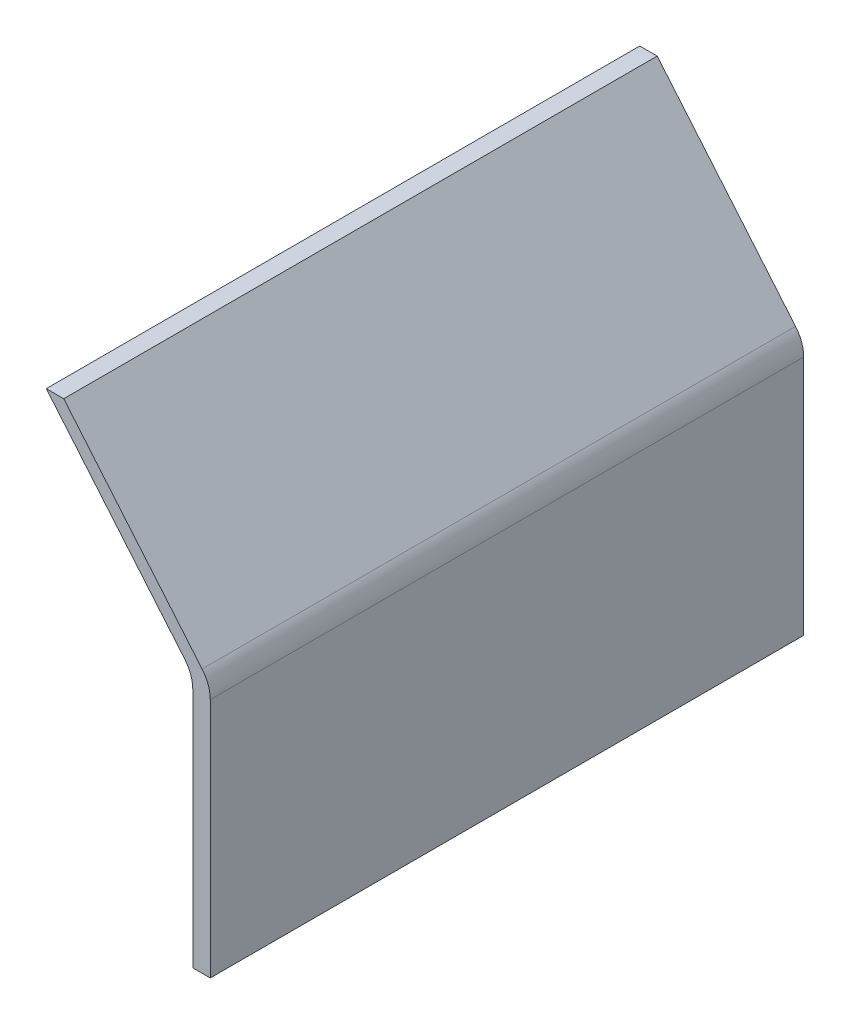
ISO-10303-21;
HEADER;
FILE_DESCRIPTION(('STEP AP214'),'2;1');
FILE_NAME('part.step','',(''),(''),'','','');
FILE_SCHEMA(('AUTOMOTIVE_DESIGN { 1 0 10303 214 1 1 1 1 }'));
ENDSEC;
DATA;
#1=APPLICATION_CONTEXT('core data for automotive mechanical design processes');
#2=APPLICATION_PROTOCOL_DEFINITION('international standard','automotive_design',2000,#1);
#3=PRODUCT_CONTEXT('',#1,'mechanical');
#4=PRODUCT('Part','Part','',(#3));
#5=PRODUCT_RELATED_PRODUCT_CATEGORY('part','',(#4));
#6=PRODUCT_DEFINITION_FORMATION('','',#4);
#7=PRODUCT_DEFINITION_CONTEXT('part definition',#1,'design');
#8=PRODUCT_DEFINITION('design','',#6,#7);
#9=PRODUCT_DEFINITION_SHAPE('','',#8);
#10=(LENGTH_UNIT() NAMED_UNIT(*) SI_UNIT(.MILLI.,.METRE.));
#11=(NAMED_UNIT(*) PLANE_ANGLE_UNIT() SI_UNIT($,.RADIAN.));
#12=(NAMED_UNIT(*) SI_UNIT($,.STERADIAN.) SOLID_ANGLE_UNIT());
#13=UNCERTAINTY_MEASURE_WITH_UNIT(LENGTH_MEASURE(1.E-05),#10,'distance_accuracy_value','');
#14=(GEOMETRIC_REPRESENTATION_CONTEXT(3) GLOBAL_UNCERTAINTY_ASSIGNED_CONTEXT((#13)) GLOBAL_UNIT_ASSIGNED_CONTEXT((#10,
#11,#12)) REPRESENTATION_CONTEXT('',''));
#15=CARTESIAN_POINT('',(0.,0.,0.));
#16=DIRECTION('',(0.,0.,1.));
#17=DIRECTION('',(1.,0.,0.));
#18=AXIS2_PLACEMENT_3D('',#15,#16,#17);
#19=CARTESIAN_POINT('',(0.,72.7,170.));
#20=DIRECTION('',(-1.,0.,0.));
#21=DIRECTION('',(0.,-1.,0.));
#22=AXIS2_PLACEMENT_3D('',#19,#20,#21);
#23=PLANE('',#22);
#24=DIRECTION('',(0.,1.,0.));
#25=VECTOR('',#24,1.);
#26=CARTESIAN_POINT('',(0.,72.7,0.));
#27=LINE('',#26,#25);
#28=CARTESIAN_POINT('',(0.,0.,0.));
#29=VERTEX_POINT('',#28);
#30=CARTESIAN_POINT('',(0.,69.060297657338,0.));
#31=VERTEX_POINT('',#30);
#32=EDGE_CURVE('E145',#29,#31,#27,.T.);
#33=ORIENTED_EDGE('',*,*,#32,.T.);
#34=DIRECTION('',(0.,0.,-1.));
#35=VECTOR('',#34,1.);
#36=CARTESIAN_POINT('',(0.,69.060297657338,170.));
#37=LINE('',#36,#35);
#38=CARTESIAN_POINT('',(0.,69.060297657338,170.));
#39=VERTEX_POINT('',#38);
#40=EDGE_CURVE('E177',#31,#39,#37,.F.);
#41=ORIENTED_EDGE('',*,*,#40,.T.);
#42=DIRECTION('',(0.,1.,0.));
#43=VECTOR('',#42,1.);
#44=CARTESIAN_POINT('',(0.,72.7,170.));
#45=LINE('',#44,#43);
#46=CARTESIAN_POINT('',(0.,0.,170.));
#47=VERTEX_POINT('',#46);
#48=EDGE_CURVE('E116',#47,#39,#45,.T.);
#49=ORIENTED_EDGE('',*,*,#48,.F.);
#50=DIRECTION('',(0.,0.,-1.));
#51=VECTOR('',#50,1.);
#52=CARTESIAN_POINT('',(0.,0.,170.));
#53=LINE('',#52,#51);
#54=EDGE_CURVE('E144',#47,#29,#53,.T.);
#55=ORIENTED_EDGE('',*,*,#54,.T.);
#56=EDGE_LOOP('',(#33,#41,#49,#55));
#57=FACE_BOUND('',#56,.T.);
#58=ADVANCED_FACE('F39',(#57),#23,.F.);
#59=CARTESIAN_POINT('',(-41.9740309125311,122.722702135669,170.));
#60=DIRECTION('',(-0.766044443118977,-0.64278760968654,0.));
#61=DIRECTION('',(0.64278760968654,-0.766044443118977,0.));
#62=AXIS2_PLACEMENT_3D('',#59,#60,#61);
#63=PLANE('',#62);
#64=DIRECTION('',(-0.64278760968654,0.766044443118977,0.));
#65=VECTOR('',#64,1.);
#66=CARTESIAN_POINT('',(-41.9740309125311,122.722702135669,170.));
#67=LINE('',#66,#65);
#68=CARTESIAN_POINT('',(-2.33955556881023,75.4881737542034,170.));
#69=VERTEX_POINT('',#68);
#70=CARTESIAN_POINT('',(-41.9740309125311,122.722702135669,170.));
#71=VERTEX_POINT('',#70);
#72=EDGE_CURVE('E103',#69,#71,#67,.T.);
#73=ORIENTED_EDGE('',*,*,#72,.F.);
#74=DIRECTION('',(0.,0.,-1.));
#75=VECTOR('',#74,1.);
#76=CARTESIAN_POINT('',(-2.33955556881022,75.4881737542034,170.));
#77=LINE('',#76,#75);
#78=CARTESIAN_POINT('',(-2.33955556881023,75.4881737542034,0.));
#79=VERTEX_POINT('',#78);
#80=EDGE_CURVE('E126',#69,#79,#77,.T.);
#81=ORIENTED_EDGE('',*,*,#80,.T.);
#82=DIRECTION('',(-0.64278760968654,0.766044443118977,0.));
#83=VECTOR('',#82,1.);
#84=CARTESIAN_POINT('',(-41.9740309125311,122.722702135669,0.));
#85=LINE('',#84,#83);
#86=CARTESIAN_POINT('',(-41.9740309125311,122.722702135669,0.));
#87=VERTEX_POINT('',#86);
#88=EDGE_CURVE('E122',#79,#87,#85,.T.);
#89=ORIENTED_EDGE('',*,*,#88,.T.);
#90=DIRECTION('',(0.,0.,-1.));
#91=VECTOR('',#90,1.);
#92=CARTESIAN_POINT('',(-41.9740309125311,122.722702135669,170.));
#93=LINE('',#92,#91);
#94=EDGE_CURVE('E119',#71,#87,#93,.T.);
#95=ORIENTED_EDGE('',*,*,#94,.F.);
#96=EDGE_LOOP('',(#73,#81,#89,#95));
#97=FACE_BOUND('',#96,.T.);
#98=ADVANCED_FACE('F120',(#97),#63,.F.);
#99=CARTESIAN_POINT('',(-46.9740309125311,122.722702135669,170.));
#100=DIRECTION('',(0.,-1.,0.));
#101=DIRECTION('',(1.,0.,0.));
#102=AXIS2_PLACEMENT_3D('',#99,#100,#101);
#103=PLANE('',#102);
#104=DIRECTION('',(-1.,0.,0.));
#105=VECTOR('',#104,1.);
#106=CARTESIAN_POINT('',(-46.9740309125311,122.722702135669,0.));
#107=LINE('',#106,#105);
#108=CARTESIAN_POINT('',(-46.9740309125311,122.722702135669,0.));
#109=VERTEX_POINT('',#108);
#110=EDGE_CURVE('E151',#87,#109,#107,.T.);
#111=ORIENTED_EDGE('',*,*,#110,.T.);
#112=DIRECTION('',(0.,0.,-1.));
#113=VECTOR('',#112,1.);
#114=CARTESIAN_POINT('',(-46.9740309125311,122.722702135669,170.));
#115=LINE('',#114,#113);
#116=CARTESIAN_POINT('',(-46.9740309125311,122.722702135669,170.));
#117=VERTEX_POINT('',#116);
#118=EDGE_CURVE('E127',#117,#109,#115,.T.);
#119=ORIENTED_EDGE('',*,*,#118,.F.);
#120=DIRECTION('',(-1.,0.,0.));
#121=VECTOR('',#120,1.);
#122=CARTESIAN_POINT('',(-46.9740309125311,122.722702135669,170.));
#123=LINE('',#122,#121);
#124=EDGE_CURVE('E108',#71,#117,#123,.T.);
#125=ORIENTED_EDGE('',*,*,#124,.F.);
#126=ORIENTED_EDGE('',*,*,#94,.T.);
#127=EDGE_LOOP('',(#111,#119,#125,#126));
#128=FACE_BOUND('',#127,.T.);
#129=ADVANCED_FACE('F129',(#128),#103,.F.);
#130=CARTESIAN_POINT('',(-5.,72.7,170.));
#131=DIRECTION('',(0.766044443118977,0.64278760968654,0.));
#132=DIRECTION('',(-0.64278760968654,0.766044443118977,0.));
#133=AXIS2_PLACEMENT_3D('',#130,#131,#132);
#134=PLANE('',#133);
#135=DIRECTION('',(0.64278760968654,-0.766044443118977,0.));
#136=VECTOR('',#135,1.);
#137=CARTESIAN_POINT('',(-5.,72.7,0.));
#138=LINE('',#137,#136);
#139=CARTESIAN_POINT('',(-7.33955556881023,75.4881737542034,0.));
#140=VERTEX_POINT('',#139);
#141=EDGE_CURVE('E154',#109,#140,#138,.T.);
#142=ORIENTED_EDGE('',*,*,#141,.T.);
#143=DIRECTION('',(0.,0.,-1.));
#144=VECTOR('',#143,1.);
#145=CARTESIAN_POINT('',(-7.33955556881023,75.4881737542034,170.));
#146=LINE('',#145,#144);
#147=CARTESIAN_POINT('',(-7.33955556881023,75.4881737542034,170.));
#148=VERTEX_POINT('',#147);
#149=EDGE_CURVE('E61',#140,#148,#146,.F.);
#150=ORIENTED_EDGE('',*,*,#149,.T.);
#151=DIRECTION('',(0.64278760968654,-0.766044443118977,0.));
#152=VECTOR('',#151,1.);
#153=CARTESIAN_POINT('',(-5.,72.7,170.));
#154=LINE('',#153,#152);
#155=EDGE_CURVE('E132',#117,#148,#154,.T.);
#156=ORIENTED_EDGE('',*,*,#155,.F.);
#157=ORIENTED_EDGE('',*,*,#118,.T.);
#158=EDGE_LOOP('',(#142,#150,#156,#157));
#159=FACE_BOUND('',#158,.T.);
#160=ADVANCED_FACE('F195',(#159),#134,.F.);
#161=CARTESIAN_POINT('',(-5.,0.,170.));
#162=DIRECTION('',(1.,0.,0.));
#163=DIRECTION('',(0.,1.,0.));
#164=AXIS2_PLACEMENT_3D('',#161,#162,#163);
#165=PLANE('',#164);
#166=DIRECTION('',(0.,-1.,0.));
#167=VECTOR('',#166,1.);
#168=CARTESIAN_POINT('',(-5.,0.,170.));
#169=LINE('',#168,#167);
#170=CARTESIAN_POINT('',(-5.,69.060297657338,170.));
#171=VERTEX_POINT('',#170);
#172=CARTESIAN_POINT('',(-5.,0.,170.));
#173=VERTEX_POINT('',#172);
#174=EDGE_CURVE('E135',#171,#173,#169,.T.);
#175=ORIENTED_EDGE('',*,*,#174,.F.);
#176=DIRECTION('',(0.,0.,-1.));
#177=VECTOR('',#176,1.);
#178=CARTESIAN_POINT('',(-5.,69.060297657338,0.));
#179=LINE('',#178,#177);
#180=CARTESIAN_POINT('',(-5.,69.060297657338,0.));
#181=VERTEX_POINT('',#180);
#182=EDGE_CURVE('E182',#171,#181,#179,.T.);
#183=ORIENTED_EDGE('',*,*,#182,.T.);
#184=DIRECTION('',(0.,-1.,0.));
#185=VECTOR('',#184,1.);
#186=CARTESIAN_POINT('',(-5.,0.,0.));
#187=LINE('',#186,#185);
#188=CARTESIAN_POINT('',(-5.,0.,0.));
#189=VERTEX_POINT('',#188);
#190=EDGE_CURVE('E157',#181,#189,#187,.T.);
#191=ORIENTED_EDGE('',*,*,#190,.T.);
#192=DIRECTION('',(0.,0.,-1.));
#193=VECTOR('',#192,1.);
#194=CARTESIAN_POINT('',(-5.,0.,170.));
#195=LINE('',#194,#193);
#196=EDGE_CURVE('E166',#173,#189,#195,.T.);
#197=ORIENTED_EDGE('',*,*,#196,.F.);
#198=EDGE_LOOP('',(#175,#183,#191,#197));
#199=FACE_BOUND('',#198,.T.);
#200=ADVANCED_FACE('F197',(#199),#165,.F.);
#201=CARTESIAN_POINT('',(0.,0.,170.));
#202=DIRECTION('',(0.,1.,0.));
#203=DIRECTION('',(-1.,0.,0.));
#204=AXIS2_PLACEMENT_3D('',#201,#202,#203);
#205=PLANE('',#204);
#206=DIRECTION('',(1.,0.,0.));
#207=VECTOR('',#206,1.);
#208=CARTESIAN_POINT('',(0.,0.,0.));
#209=LINE('',#208,#207);
#210=EDGE_CURVE('E160',#189,#29,#209,.T.);
#211=ORIENTED_EDGE('',*,*,#210,.T.);
#212=ORIENTED_EDGE('',*,*,#54,.F.);
#213=DIRECTION('',(1.,0.,0.));
#214=VECTOR('',#213,1.);
#215=CARTESIAN_POINT('',(0.,0.,170.));
#216=LINE('',#215,#214);
#217=EDGE_CURVE('E141',#173,#47,#216,.T.);
#218=ORIENTED_EDGE('',*,*,#217,.F.);
#219=ORIENTED_EDGE('',*,*,#196,.T.);
#220=EDGE_LOOP('',(#211,#212,#218,#219));
#221=FACE_BOUND('',#220,.T.);
#222=ADVANCED_FACE('F203',(#221),#205,.F.);
#223=CARTESIAN_POINT('',(0.,0.,170.));
#224=DIRECTION('',(0.,0.,-1.));
#225=DIRECTION('',(-1.,0.,0.));
#226=AXIS2_PLACEMENT_3D('',#223,#224,#225);
#227=PLANE('',#226);
#228=ORIENTED_EDGE('',*,*,#48,.T.);
#229=CARTESIAN_POINT('',(-9.99999999999999,69.060297657338,170.));
#230=DIRECTION('',(0.,0.,-1.));
#231=DIRECTION('',(-1.,0.,0.));
#232=AXIS2_PLACEMENT_3D('',#229,#230,#231);
#233=CIRCLE('',#232,10.);
#234=EDGE_CURVE('E111',#39,#69,#233,.F.);
#235=ORIENTED_EDGE('',*,*,#234,.T.);
#236=ORIENTED_EDGE('',*,*,#72,.T.);
#237=ORIENTED_EDGE('',*,*,#124,.T.);
#238=ORIENTED_EDGE('',*,*,#155,.T.);
#239=CARTESIAN_POINT('',(-15.,69.060297657338,170.));
#240=DIRECTION('',(0.,0.,-1.));
#241=DIRECTION('',(-1.,0.,0.));
#242=AXIS2_PLACEMENT_3D('',#239,#240,#241);
#243=CIRCLE('',#242,10.);
#244=EDGE_CURVE('E11',#148,#171,#243,.T.);
#245=ORIENTED_EDGE('',*,*,#244,.T.);
#246=ORIENTED_EDGE('',*,*,#174,.T.);
#247=ORIENTED_EDGE('',*,*,#217,.T.);
#248=EDGE_LOOP('',(#228,#235,#236,#237,#238,#245,#246,#247));
#249=FACE_BOUND('',#248,.T.);
#250=ADVANCED_FACE('F106',(#249),#227,.F.);
#251=CARTESIAN_POINT('',(0.,0.,0.));
#252=DIRECTION('',(0.,0.,-1.));
#253=DIRECTION('',(-1.,0.,0.));
#254=AXIS2_PLACEMENT_3D('',#251,#252,#253);
#255=PLANE('',#254);
#256=ORIENTED_EDGE('',*,*,#88,.F.);
#257=CARTESIAN_POINT('',(-9.99999999999999,69.060297657338,0.));
#258=DIRECTION('',(0.,0.,-1.));
#259=DIRECTION('',(-1.,0.,0.));
#260=AXIS2_PLACEMENT_3D('',#257,#258,#259);
#261=CIRCLE('',#260,10.);
#262=EDGE_CURVE('E174',#79,#31,#261,.T.);
#263=ORIENTED_EDGE('',*,*,#262,.T.);
#264=ORIENTED_EDGE('',*,*,#32,.F.);
#265=ORIENTED_EDGE('',*,*,#210,.F.);
#266=ORIENTED_EDGE('',*,*,#190,.F.);
#267=CARTESIAN_POINT('',(-15.,69.060297657338,0.));
#268=DIRECTION('',(0.,0.,-1.));
#269=DIRECTION('',(-1.,0.,0.));
#270=AXIS2_PLACEMENT_3D('',#267,#268,#269);
#271=CIRCLE('',#270,10.);
#272=EDGE_CURVE('E48',#181,#140,#271,.F.);
#273=ORIENTED_EDGE('',*,*,#272,.T.);
#274=ORIENTED_EDGE('',*,*,#141,.F.);
#275=ORIENTED_EDGE('',*,*,#110,.F.);
#276=EDGE_LOOP('',(#256,#263,#264,#265,#266,#273,#274,#275));
#277=FACE_BOUND('',#276,.T.);
#278=ADVANCED_FACE('F191',(#277),#255,.T.);
#279=CARTESIAN_POINT('',(-9.99999999999999,69.060297657338,170.));
#280=DIRECTION('',(0.,0.,-1.));
#281=DIRECTION('',(-1.,0.,0.));
#282=AXIS2_PLACEMENT_3D('',#279,#280,#281);
#283=CYLINDRICAL_SURFACE('',#282,10.);
#284=ORIENTED_EDGE('',*,*,#234,.F.);
#285=ORIENTED_EDGE('',*,*,#40,.F.);
#286=ORIENTED_EDGE('',*,*,#262,.F.);
#287=ORIENTED_EDGE('',*,*,#80,.F.);
#288=EDGE_LOOP('',(#284,#285,#286,#287));
#289=FACE_BOUND('',#288,.T.);
#290=ADVANCED_FACE('F209',(#289),#283,.T.);
#291=CARTESIAN_POINT('',(-15.,69.060297657338,170.));
#292=DIRECTION('',(0.,0.,1.));
#293=DIRECTION('',(1.,0.,0.));
#294=AXIS2_PLACEMENT_3D('',#291,#292,#293);
#295=CYLINDRICAL_SURFACE('',#294,10.);
#296=ORIENTED_EDGE('',*,*,#244,.F.);
#297=ORIENTED_EDGE('',*,*,#149,.F.);
#298=ORIENTED_EDGE('',*,*,#272,.F.);
#299=ORIENTED_EDGE('',*,*,#182,.F.);
#300=EDGE_LOOP('',(#296,#297,#298,#299));
#301=FACE_BOUND('',#300,.T.);
#302=ADVANCED_FACE('F41',(#301),#295,.F.);
#303=CLOSED_SHELL('',(#58,#98,#129,#160,#200,#222,#250,#278,#290,#302));
#304=MANIFOLD_SOLID_BREP('B2',#303);
#305=ADVANCED_BREP_SHAPE_REPRESENTATION('',(#18,#304),#14);
#306=SHAPE_DEFINITION_REPRESENTATION(#9,#305);
ENDSEC;
END-ISO-10303-21;
